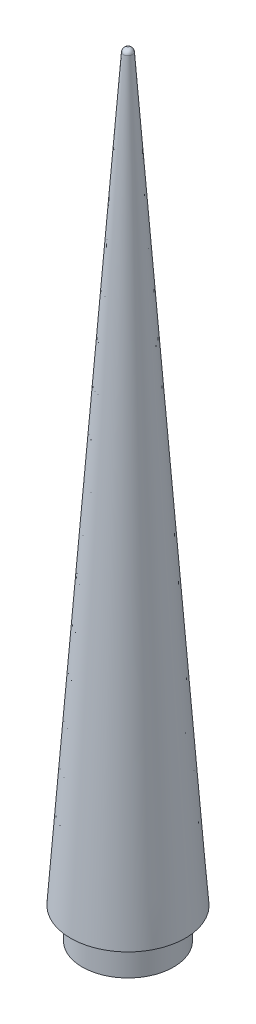
ISO-10303-21;
HEADER;
FILE_DESCRIPTION(('STEP AP214'),'2;1');
FILE_NAME('part.step','',(''),(''),'','','');
FILE_SCHEMA(('AUTOMOTIVE_DESIGN { 1 0 10303 214 1 1 1 1 }'));
ENDSEC;
DATA;
#1=APPLICATION_CONTEXT('core data for automotive mechanical design processes');
#2=APPLICATION_PROTOCOL_DEFINITION('international standard','automotive_design',2000,#1);
#3=PRODUCT_CONTEXT('',#1,'mechanical');
#4=PRODUCT('Part','Part','',(#3));
#5=PRODUCT_RELATED_PRODUCT_CATEGORY('part','',(#4));
#6=PRODUCT_DEFINITION_FORMATION('','',#4);
#7=PRODUCT_DEFINITION_CONTEXT('part definition',#1,'design');
#8=PRODUCT_DEFINITION('design','',#6,#7);
#9=PRODUCT_DEFINITION_SHAPE('','',#8);
#10=(LENGTH_UNIT() NAMED_UNIT(*) SI_UNIT(.MILLI.,.METRE.));
#11=(NAMED_UNIT(*) PLANE_ANGLE_UNIT() SI_UNIT($,.RADIAN.));
#12=(NAMED_UNIT(*) SI_UNIT($,.STERADIAN.) SOLID_ANGLE_UNIT());
#13=UNCERTAINTY_MEASURE_WITH_UNIT(LENGTH_MEASURE(1.E-05),#10,'distance_accuracy_value','');
#14=(GEOMETRIC_REPRESENTATION_CONTEXT(3) GLOBAL_UNCERTAINTY_ASSIGNED_CONTEXT((#13)) GLOBAL_UNIT_ASSIGNED_CONTEXT((#10,
#11,#12)) REPRESENTATION_CONTEXT('',''));
#15=CARTESIAN_POINT('',(0.,0.,0.));
#16=DIRECTION('',(0.,0.,1.));
#17=DIRECTION('',(1.,0.,0.));
#18=AXIS2_PLACEMENT_3D('',#15,#16,#17);
#19=CARTESIAN_POINT('',(0.,6.35,0.));
#20=DIRECTION('',(0.,-1.,0.));
#21=DIRECTION('',(0.,0.,-1.));
#22=AXIS2_PLACEMENT_3D('',#19,#20,#21);
#23=CYLINDRICAL_SURFACE('',#22,9.398);
#24=CARTESIAN_POINT('',(0.,6.35,0.));
#25=DIRECTION('',(0.,1.,0.));
#26=DIRECTION('',(0.,0.,1.));
#27=AXIS2_PLACEMENT_3D('',#24,#25,#26);
#28=CIRCLE('',#27,9.398);
#29=CARTESIAN_POINT('',(0.,6.35,9.398));
#30=VERTEX_POINT('',#29);
#31=EDGE_CURVE('E54',#30,#30,#28,.T.);
#32=ORIENTED_EDGE('',*,*,#31,.F.);
#33=EDGE_LOOP('',(#32));
#34=FACE_BOUND('',#33,.T.);
#35=CARTESIAN_POINT('',(0.,0.,0.));
#36=DIRECTION('',(0.,1.,0.));
#37=DIRECTION('',(0.,0.,1.));
#38=AXIS2_PLACEMENT_3D('',#35,#36,#37);
#39=CIRCLE('',#38,9.398);
#40=CARTESIAN_POINT('',(0.,0.,9.398));
#41=VERTEX_POINT('',#40);
#42=EDGE_CURVE('E59',#41,#41,#39,.T.);
#43=ORIENTED_EDGE('',*,*,#42,.T.);
#44=EDGE_LOOP('',(#43));
#45=FACE_BOUND('',#44,.T.);
#46=ADVANCED_FACE('F43',(#34,#45),#23,.T.);
#47=CARTESIAN_POINT('',(0.,0.,0.));
#48=DIRECTION('',(0.,1.,0.));
#49=DIRECTION('',(0.,0.,1.));
#50=AXIS2_PLACEMENT_3D('',#47,#48,#49);
#51=PLANE('',#50);
#52=ORIENTED_EDGE('',*,*,#42,.F.);
#53=EDGE_LOOP('',(#52));
#54=FACE_BOUND('',#53,.T.);
#55=ADVANCED_FACE('F75',(#54),#51,.F.);
#56=CARTESIAN_POINT('',(0.,6.35000000000001,0.));
#57=DIRECTION('',(0.,1.,0.));
#58=DIRECTION('',(0.,0.,1.));
#59=AXIS2_PLACEMENT_3D('',#56,#57,#58);
#60=PLANE('',#59);
#61=ORIENTED_EDGE('',*,*,#31,.T.);
#62=EDGE_LOOP('',(#61));
#63=FACE_BOUND('',#62,.T.);
#64=CARTESIAN_POINT('',(0.,6.35000000000002,0.));
#65=DIRECTION('',(0.,1.,0.));
#66=DIRECTION('',(0.,0.,1.));
#67=AXIS2_PLACEMENT_3D('',#64,#65,#66);
#68=CIRCLE('',#67,11.811);
#69=CARTESIAN_POINT('',(0.,6.35000000000002,11.811));
#70=VERTEX_POINT('',#69);
#71=EDGE_CURVE('E64',#70,#70,#68,.T.);
#72=ORIENTED_EDGE('',*,*,#71,.F.);
#73=EDGE_LOOP('',(#72));
#74=FACE_BOUND('',#73,.T.);
#75=ADVANCED_FACE('F72',(#63,#74),#60,.F.);
#76=CARTESIAN_POINT('',(0.,159.258,0.));
#77=DIRECTION('',(0.,-1.,0.));
#78=DIRECTION('',(0.,0.,-1.));
#79=AXIS2_PLACEMENT_3D('',#76,#77,#78);
#80=PLANE('',#79);
#81=CARTESIAN_POINT('',(0.,159.258,0.));
#82=DIRECTION('',(0.,-1.,0.));
#83=DIRECTION('',(0.,0.,-1.));
#84=AXIS2_PLACEMENT_3D('',#81,#82,#83);
#85=CIRCLE('',#84,0.0612350281762431);
#86=CARTESIAN_POINT('',(0.,159.258,-0.0612350281762431));
#87=VERTEX_POINT('',#86);
#88=EDGE_CURVE('E50',#87,#87,#85,.F.);
#89=ORIENTED_EDGE('',*,*,#88,.T.);
#90=EDGE_LOOP('',(#89));
#91=FACE_BOUND('',#90,.T.);
#92=ADVANCED_FACE('F74',(#91),#80,.F.);
#93=CARTESIAN_POINT('',(0.,6.35000000000002,0.));
#94=DIRECTION('',(0.,-1.,0.));
#95=DIRECTION('',(0.,0.,-1.));
#96=AXIS2_PLACEMENT_3D('',#93,#94,#95);
#97=CONICAL_SURFACE('',#96,11.811,0.0713074647852903);
#98=CARTESIAN_POINT('',(0.,158.432338627439,0.));
#99=DIRECTION('',(0.,1.,0.));
#100=DIRECTION('',(0.,0.,1.));
#101=AXIS2_PLACEMENT_3D('',#98,#99,#100);
#102=CIRCLE('',#101,0.947975812325768);
#103=CARTESIAN_POINT('',(0.,158.432338627439,0.947975812325768));
#104=VERTEX_POINT('',#103);
#105=EDGE_CURVE('E10',#104,#104,#102,.F.);
#106=ORIENTED_EDGE('',*,*,#105,.T.);
#107=EDGE_LOOP('',(#106));
#108=FACE_BOUND('',#107,.T.);
#109=ORIENTED_EDGE('',*,*,#71,.T.);
#110=EDGE_LOOP('',(#109));
#111=FACE_BOUND('',#110,.T.);
#112=ADVANCED_FACE('F70',(#108,#111),#97,.T.);
#113=CARTESIAN_POINT('',(0.,158.369,0.));
#114=DIRECTION('',(0.,-1.,0.));
#115=DIRECTION('',(0.,0.,-1.));
#116=AXIS2_PLACEMENT_3D('',#113,#114,#115);
#117=DEGENERATE_TOROIDAL_SURFACE('',#116,0.0612350281762431,0.889,.T.);
#118=ORIENTED_EDGE('',*,*,#105,.F.);
#119=EDGE_LOOP('',(#118));
#120=FACE_BOUND('',#119,.T.);
#121=ORIENTED_EDGE('',*,*,#88,.F.);
#122=EDGE_LOOP('',(#121));
#123=FACE_BOUND('',#122,.T.);
#124=ADVANCED_FACE('F45',(#120,#123),#117,.T.);
#125=CLOSED_SHELL('',(#46,#55,#75,#92,#112,#124));
#126=MANIFOLD_SOLID_BREP('B2',#125);
#127=ADVANCED_BREP_SHAPE_REPRESENTATION('',(#18,#126),#14);
#128=SHAPE_DEFINITION_REPRESENTATION(#9,#127);
ENDSEC;
END-ISO-10303-21;
